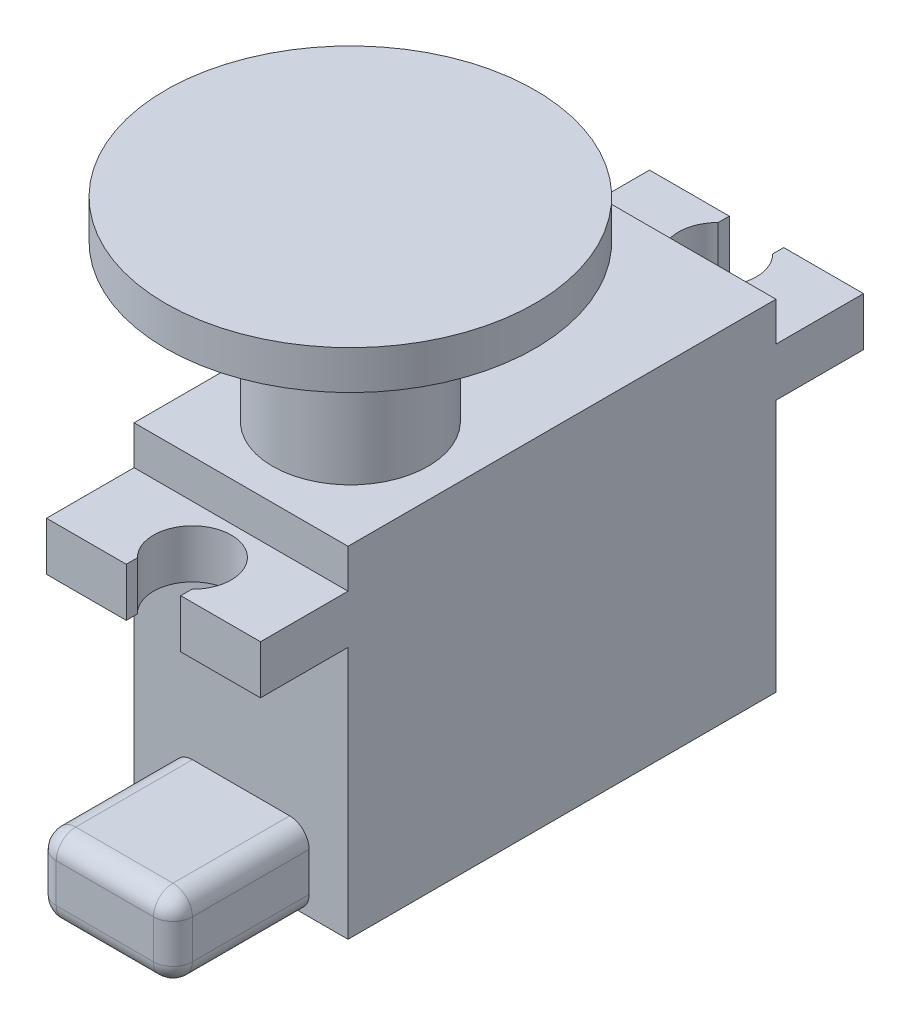
ISO-10303-21;
HEADER;
FILE_DESCRIPTION(('STEP AP214'),'2;1');
FILE_NAME('part.step','',(''),(''),'','','');
FILE_SCHEMA(('AUTOMOTIVE_DESIGN { 1 0 10303 214 1 1 1 1 }'));
ENDSEC;
DATA;
#1=APPLICATION_CONTEXT('core data for automotive mechanical design processes');
#2=APPLICATION_PROTOCOL_DEFINITION('international standard','automotive_design',2000,#1);
#3=PRODUCT_CONTEXT('',#1,'mechanical');
#4=PRODUCT('Part','Part','',(#3));
#5=PRODUCT_RELATED_PRODUCT_CATEGORY('part','',(#4));
#6=PRODUCT_DEFINITION_FORMATION('','',#4);
#7=PRODUCT_DEFINITION_CONTEXT('part definition',#1,'design');
#8=PRODUCT_DEFINITION('design','',#6,#7);
#9=PRODUCT_DEFINITION_SHAPE('','',#8);
#10=(LENGTH_UNIT() NAMED_UNIT(*) SI_UNIT(.MILLI.,.METRE.));
#11=(NAMED_UNIT(*) PLANE_ANGLE_UNIT() SI_UNIT($,.RADIAN.));
#12=(NAMED_UNIT(*) SI_UNIT($,.STERADIAN.) SOLID_ANGLE_UNIT());
#13=UNCERTAINTY_MEASURE_WITH_UNIT(LENGTH_MEASURE(1.E-05),#10,'distance_accuracy_value','');
#14=(GEOMETRIC_REPRESENTATION_CONTEXT(3) GLOBAL_UNCERTAINTY_ASSIGNED_CONTEXT((#13)) GLOBAL_UNIT_ASSIGNED_CONTEXT((#10,
#11,#12)) REPRESENTATION_CONTEXT('',''));
#15=CARTESIAN_POINT('',(0.,0.,0.));
#16=DIRECTION('',(0.,0.,1.));
#17=DIRECTION('',(1.,0.,0.));
#18=AXIS2_PLACEMENT_3D('',#15,#16,#17);
#19=CARTESIAN_POINT('',(0.,0.,-15.5));
#20=DIRECTION('',(0.,0.,-1.));
#21=DIRECTION('',(-1.,0.,0.));
#22=AXIS2_PLACEMENT_3D('',#19,#20,#21);
#23=PLANE('',#22);
#24=DIRECTION('',(0.,1.,0.));
#25=VECTOR('',#24,1.);
#26=CARTESIAN_POINT('',(-1.4,0.,-15.5));
#27=LINE('',#26,#25);
#28=CARTESIAN_POINT('',(-1.4,13.,-15.5));
#29=VERTEX_POINT('',#28);
#30=CARTESIAN_POINT('',(-1.4,15.5,-15.5));
#31=VERTEX_POINT('',#30);
#32=EDGE_CURVE('E42',#29,#31,#27,.T.);
#33=ORIENTED_EDGE('',*,*,#32,.F.);
#34=DIRECTION('',(-1.,0.,0.));
#35=VECTOR('',#34,1.);
#36=CARTESIAN_POINT('',(5.5,13.,-15.5));
#37=LINE('',#36,#35);
#38=CARTESIAN_POINT('',(-5.5,13.,-15.5));
#39=VERTEX_POINT('',#38);
#40=EDGE_CURVE('E278',#29,#39,#37,.T.);
#41=ORIENTED_EDGE('',*,*,#40,.T.);
#42=DIRECTION('',(0.,1.,0.));
#43=VECTOR('',#42,1.);
#44=CARTESIAN_POINT('',(-5.5,15.5,-15.5));
#45=LINE('',#44,#43);
#46=CARTESIAN_POINT('',(-5.5,15.5,-15.5));
#47=VERTEX_POINT('',#46);
#48=EDGE_CURVE('E282',#39,#47,#45,.T.);
#49=ORIENTED_EDGE('',*,*,#48,.T.);
#50=DIRECTION('',(1.,0.,0.));
#51=VECTOR('',#50,1.);
#52=CARTESIAN_POINT('',(5.5,15.5,-15.5));
#53=LINE('',#52,#51);
#54=EDGE_CURVE('E285',#47,#31,#53,.T.);
#55=ORIENTED_EDGE('',*,*,#54,.T.);
#56=EDGE_LOOP('',(#33,#41,#49,#55));
#57=FACE_BOUND('',#56,.T.);
#58=ADVANCED_FACE('F34',(#57),#23,.T.);
#59=CARTESIAN_POINT('',(0.,0.,15.5));
#60=DIRECTION('',(0.,0.,1.));
#61=DIRECTION('',(1.,0.,0.));
#62=AXIS2_PLACEMENT_3D('',#59,#60,#61);
#63=PLANE('',#62);
#64=DIRECTION('',(0.,1.,0.));
#65=VECTOR('',#64,1.);
#66=CARTESIAN_POINT('',(1.4,0.,15.5));
#67=LINE('',#66,#65);
#68=CARTESIAN_POINT('',(1.4,13.,15.5));
#69=VERTEX_POINT('',#68);
#70=CARTESIAN_POINT('',(1.4,15.5,15.5));
#71=VERTEX_POINT('',#70);
#72=EDGE_CURVE('E324',#69,#71,#67,.T.);
#73=ORIENTED_EDGE('',*,*,#72,.F.);
#74=DIRECTION('',(1.,0.,0.));
#75=VECTOR('',#74,1.);
#76=CARTESIAN_POINT('',(-5.5,13.,15.5));
#77=LINE('',#76,#75);
#78=CARTESIAN_POINT('',(5.5,13.,15.5));
#79=VERTEX_POINT('',#78);
#80=EDGE_CURVE('E606',#69,#79,#77,.T.);
#81=ORIENTED_EDGE('',*,*,#80,.T.);
#82=DIRECTION('',(0.,1.,0.));
#83=VECTOR('',#82,1.);
#84=CARTESIAN_POINT('',(5.5,15.5,15.5));
#85=LINE('',#84,#83);
#86=CARTESIAN_POINT('',(5.5,15.5,15.5));
#87=VERTEX_POINT('',#86);
#88=EDGE_CURVE('E719',#79,#87,#85,.T.);
#89=ORIENTED_EDGE('',*,*,#88,.T.);
#90=DIRECTION('',(-1.,0.,0.));
#91=VECTOR('',#90,1.);
#92=CARTESIAN_POINT('',(-5.5,15.5,15.5));
#93=LINE('',#92,#91);
#94=EDGE_CURVE('E613',#87,#71,#93,.T.);
#95=ORIENTED_EDGE('',*,*,#94,.T.);
#96=EDGE_LOOP('',(#73,#81,#89,#95));
#97=FACE_BOUND('',#96,.T.);
#98=ADVANCED_FACE('F397',(#97),#63,.T.);
#99=CARTESIAN_POINT('',(5.5,17.5,-11.));
#100=DIRECTION('',(0.,0.,1.));
#101=DIRECTION('',(1.,0.,0.));
#102=AXIS2_PLACEMENT_3D('',#99,#100,#101);
#103=PLANE('',#102);
#104=DIRECTION('',(1.,0.,0.));
#105=VECTOR('',#104,1.);
#106=CARTESIAN_POINT('',(5.5,15.5,-11.));
#107=LINE('',#106,#105);
#108=CARTESIAN_POINT('',(-5.5,15.5,-11.));
#109=VERTEX_POINT('',#108);
#110=CARTESIAN_POINT('',(5.5,15.5,-11.));
#111=VERTEX_POINT('',#110);
#112=EDGE_CURVE('E279',#109,#111,#107,.T.);
#113=ORIENTED_EDGE('',*,*,#112,.F.);
#114=DIRECTION('',(0.,-1.,0.));
#115=VECTOR('',#114,1.);
#116=CARTESIAN_POINT('',(-5.5,17.5,-11.));
#117=LINE('',#116,#115);
#118=CARTESIAN_POINT('',(-5.5,17.5,-11.));
#119=VERTEX_POINT('',#118);
#120=EDGE_CURVE('E347',#119,#109,#117,.T.);
#121=ORIENTED_EDGE('',*,*,#120,.F.);
#122=DIRECTION('',(-1.,0.,0.));
#123=VECTOR('',#122,1.);
#124=CARTESIAN_POINT('',(5.5,17.5,-11.));
#125=LINE('',#124,#123);
#126=CARTESIAN_POINT('',(5.5,17.5,-11.));
#127=VERTEX_POINT('',#126);
#128=EDGE_CURVE('E573',#127,#119,#125,.T.);
#129=ORIENTED_EDGE('',*,*,#128,.F.);
#130=DIRECTION('',(0.,-1.,0.));
#131=VECTOR('',#130,1.);
#132=CARTESIAN_POINT('',(5.5,17.5,-11.));
#133=LINE('',#132,#131);
#134=EDGE_CURVE('E357',#127,#111,#133,.T.);
#135=ORIENTED_EDGE('',*,*,#134,.T.);
#136=EDGE_LOOP('',(#113,#121,#129,#135));
#137=FACE_BOUND('',#136,.T.);
#138=ADVANCED_FACE('F402',(#137),#103,.F.);
#139=DIRECTION('',(-1.,0.,0.));
#140=VECTOR('',#139,1.);
#141=CARTESIAN_POINT('',(5.5,13.,-11.));
#142=LINE('',#141,#140);
#143=CARTESIAN_POINT('',(5.5,13.,-11.));
#144=VERTEX_POINT('',#143);
#145=CARTESIAN_POINT('',(-5.5,13.,-11.));
#146=VERTEX_POINT('',#145);
#147=EDGE_CURVE('E274',#144,#146,#142,.T.);
#148=ORIENTED_EDGE('',*,*,#147,.F.);
#149=CARTESIAN_POINT('',(5.5,0.,-11.));
#150=VERTEX_POINT('',#149);
#151=EDGE_CURVE('E297',#144,#150,#133,.T.);
#152=ORIENTED_EDGE('',*,*,#151,.T.);
#153=DIRECTION('',(-1.,0.,0.));
#154=VECTOR('',#153,1.);
#155=CARTESIAN_POINT('',(5.5,0.,-11.));
#156=LINE('',#155,#154);
#157=CARTESIAN_POINT('',(-5.5,0.,-11.));
#158=VERTEX_POINT('',#157);
#159=EDGE_CURVE('E539',#150,#158,#156,.T.);
#160=ORIENTED_EDGE('',*,*,#159,.T.);
#161=EDGE_CURVE('E536',#146,#158,#117,.T.);
#162=ORIENTED_EDGE('',*,*,#161,.F.);
#163=EDGE_LOOP('',(#148,#152,#160,#162));
#164=FACE_BOUND('',#163,.T.);
#165=ADVANCED_FACE('F459',(#164),#103,.F.);
#166=CARTESIAN_POINT('',(5.5,17.5,11.));
#167=DIRECTION('',(0.,0.,-1.));
#168=DIRECTION('',(-1.,0.,0.));
#169=AXIS2_PLACEMENT_3D('',#166,#167,#168);
#170=PLANE('',#169);
#171=DIRECTION('',(1.,0.,0.));
#172=VECTOR('',#171,1.);
#173=CARTESIAN_POINT('',(-5.5,13.,11.));
#174=LINE('',#173,#172);
#175=CARTESIAN_POINT('',(-5.5,13.,11.));
#176=VERTEX_POINT('',#175);
#177=CARTESIAN_POINT('',(5.5,13.,11.));
#178=VERTEX_POINT('',#177);
#179=EDGE_CURVE('E309',#176,#178,#174,.T.);
#180=ORIENTED_EDGE('',*,*,#179,.F.);
#181=DIRECTION('',(0.,-1.,0.));
#182=VECTOR('',#181,1.);
#183=CARTESIAN_POINT('',(-5.5,17.5,11.));
#184=LINE('',#183,#182);
#185=CARTESIAN_POINT('',(-5.5,0.,11.));
#186=VERTEX_POINT('',#185);
#187=EDGE_CURVE('E587',#176,#186,#184,.T.);
#188=ORIENTED_EDGE('',*,*,#187,.T.);
#189=DIRECTION('',(1.,0.,0.));
#190=VECTOR('',#189,1.);
#191=CARTESIAN_POINT('',(5.5,0.,11.));
#192=LINE('',#191,#190);
#193=CARTESIAN_POINT('',(-2.5,0.,11.));
#194=VERTEX_POINT('',#193);
#195=EDGE_CURVE('E556',#186,#194,#192,.T.);
#196=ORIENTED_EDGE('',*,*,#195,.T.);
#197=CARTESIAN_POINT('',(-2.5,1.,11.));
#198=DIRECTION('',(0.,0.,-1.));
#199=DIRECTION('',(-1.,0.,0.));
#200=AXIS2_PLACEMENT_3D('',#197,#198,#199);
#201=CIRCLE('',#200,1.);
#202=CARTESIAN_POINT('',(-3.5,1.,11.));
#203=VERTEX_POINT('',#202);
#204=EDGE_CURVE('E644',#194,#203,#201,.T.);
#205=ORIENTED_EDGE('',*,*,#204,.T.);
#206=DIRECTION('',(0.,-1.,0.));
#207=VECTOR('',#206,1.);
#208=CARTESIAN_POINT('',(-3.5,0.,11.));
#209=LINE('',#208,#207);
#210=CARTESIAN_POINT('',(-3.5,3.00000000000001,11.));
#211=VERTEX_POINT('',#210);
#212=EDGE_CURVE('E577',#211,#203,#209,.T.);
#213=ORIENTED_EDGE('',*,*,#212,.F.);
#214=CARTESIAN_POINT('',(-2.5,3.00000000000001,11.));
#215=DIRECTION('',(0.,0.,-1.));
#216=DIRECTION('',(-1.,0.,0.));
#217=AXIS2_PLACEMENT_3D('',#214,#215,#216);
#218=CIRCLE('',#217,1.);
#219=CARTESIAN_POINT('',(-2.5,4.00000000000001,11.));
#220=VERTEX_POINT('',#219);
#221=EDGE_CURVE('E646',#211,#220,#218,.T.);
#222=ORIENTED_EDGE('',*,*,#221,.T.);
#223=DIRECTION('',(-1.,0.,0.));
#224=VECTOR('',#223,1.);
#225=CARTESIAN_POINT('',(-3.5,4.00000000000001,11.));
#226=LINE('',#225,#224);
#227=CARTESIAN_POINT('',(2.5,4.00000000000001,11.));
#228=VERTEX_POINT('',#227);
#229=EDGE_CURVE('E528',#228,#220,#226,.T.);
#230=ORIENTED_EDGE('',*,*,#229,.F.);
#231=CARTESIAN_POINT('',(2.5,3.00000000000001,11.));
#232=DIRECTION('',(0.,0.,-1.));
#233=DIRECTION('',(-1.,0.,0.));
#234=AXIS2_PLACEMENT_3D('',#231,#232,#233);
#235=CIRCLE('',#234,1.);
#236=CARTESIAN_POINT('',(3.5,3.00000000000001,11.));
#237=VERTEX_POINT('',#236);
#238=EDGE_CURVE('E648',#228,#237,#235,.T.);
#239=ORIENTED_EDGE('',*,*,#238,.T.);
#240=DIRECTION('',(0.,1.,0.));
#241=VECTOR('',#240,1.);
#242=CARTESIAN_POINT('',(3.5,0.,11.));
#243=LINE('',#242,#241);
#244=CARTESIAN_POINT('',(3.5,1.,11.));
#245=VERTEX_POINT('',#244);
#246=EDGE_CURVE('E524',#245,#237,#243,.T.);
#247=ORIENTED_EDGE('',*,*,#246,.F.);
#248=CARTESIAN_POINT('',(2.5,1.,11.));
#249=DIRECTION('',(0.,0.,-1.));
#250=DIRECTION('',(-1.,0.,0.));
#251=AXIS2_PLACEMENT_3D('',#248,#249,#250);
#252=CIRCLE('',#251,1.);
#253=CARTESIAN_POINT('',(2.5,0.,11.));
#254=VERTEX_POINT('',#253);
#255=EDGE_CURVE('E650',#245,#254,#252,.T.);
#256=ORIENTED_EDGE('',*,*,#255,.T.);
#257=CARTESIAN_POINT('',(5.5,0.,11.));
#258=VERTEX_POINT('',#257);
#259=EDGE_CURVE('E576',#254,#258,#192,.T.);
#260=ORIENTED_EDGE('',*,*,#259,.T.);
#261=DIRECTION('',(0.,-1.,0.));
#262=VECTOR('',#261,1.);
#263=CARTESIAN_POINT('',(5.5,17.5,11.));
#264=LINE('',#263,#262);
#265=EDGE_CURVE('E547',#178,#258,#264,.T.);
#266=ORIENTED_EDGE('',*,*,#265,.F.);
#267=EDGE_LOOP('',(#180,#188,#196,#205,#213,#222,#230,#239,#247,#256,#260,#266));
#268=FACE_BOUND('',#267,.T.);
#269=ADVANCED_FACE('F462',(#268),#170,.F.);
#270=DIRECTION('',(-1.,0.,0.));
#271=VECTOR('',#270,1.);
#272=CARTESIAN_POINT('',(-5.5,15.5,11.));
#273=LINE('',#272,#271);
#274=CARTESIAN_POINT('',(5.5,15.5,11.));
#275=VERTEX_POINT('',#274);
#276=CARTESIAN_POINT('',(-5.5,15.5,11.));
#277=VERTEX_POINT('',#276);
#278=EDGE_CURVE('E600',#275,#277,#273,.T.);
#279=ORIENTED_EDGE('',*,*,#278,.F.);
#280=CARTESIAN_POINT('',(5.5,17.5,11.));
#281=VERTEX_POINT('',#280);
#282=EDGE_CURVE('E544',#281,#275,#264,.T.);
#283=ORIENTED_EDGE('',*,*,#282,.F.);
#284=DIRECTION('',(1.,0.,0.));
#285=VECTOR('',#284,1.);
#286=CARTESIAN_POINT('',(5.5,17.5,11.));
#287=LINE('',#286,#285);
#288=CARTESIAN_POINT('',(-5.5,17.5,11.));
#289=VERTEX_POINT('',#288);
#290=EDGE_CURVE('E562',#289,#281,#287,.T.);
#291=ORIENTED_EDGE('',*,*,#290,.F.);
#292=EDGE_CURVE('E584',#289,#277,#184,.T.);
#293=ORIENTED_EDGE('',*,*,#292,.T.);
#294=EDGE_LOOP('',(#279,#283,#291,#293));
#295=FACE_BOUND('',#294,.T.);
#296=ADVANCED_FACE('F465',(#295),#170,.F.);
#297=CARTESIAN_POINT('',(-5.5,17.5,11.));
#298=DIRECTION('',(1.,0.,0.));
#299=DIRECTION('',(0.,0.,-1.));
#300=AXIS2_PLACEMENT_3D('',#297,#298,#299);
#301=PLANE('',#300);
#302=DIRECTION('',(0.,0.,1.));
#303=VECTOR('',#302,1.);
#304=CARTESIAN_POINT('',(-5.5,0.,11.));
#305=LINE('',#304,#303);
#306=EDGE_CURVE('E559',#158,#186,#305,.T.);
#307=ORIENTED_EDGE('',*,*,#306,.T.);
#308=ORIENTED_EDGE('',*,*,#187,.F.);
#309=DIRECTION('',(0.,0.,-1.));
#310=VECTOR('',#309,1.);
#311=CARTESIAN_POINT('',(-5.5,13.,15.5));
#312=LINE('',#311,#310);
#313=CARTESIAN_POINT('',(-5.5,13.,15.5));
#314=VERTEX_POINT('',#313);
#315=EDGE_CURVE('E617',#314,#176,#312,.T.);
#316=ORIENTED_EDGE('',*,*,#315,.F.);
#317=DIRECTION('',(0.,-1.,0.));
#318=VECTOR('',#317,1.);
#319=CARTESIAN_POINT('',(-5.5,15.5,15.5));
#320=LINE('',#319,#318);
#321=CARTESIAN_POINT('',(-5.5,15.5,15.5));
#322=VERTEX_POINT('',#321);
#323=EDGE_CURVE('E603',#322,#314,#320,.T.);
#324=ORIENTED_EDGE('',*,*,#323,.F.);
#325=DIRECTION('',(0.,0.,-1.));
#326=VECTOR('',#325,1.);
#327=CARTESIAN_POINT('',(-5.5,15.5,15.5));
#328=LINE('',#327,#326);
#329=EDGE_CURVE('E611',#322,#277,#328,.T.);
#330=ORIENTED_EDGE('',*,*,#329,.T.);
#331=ORIENTED_EDGE('',*,*,#292,.F.);
#332=DIRECTION('',(0.,0.,1.));
#333=VECTOR('',#332,1.);
#334=CARTESIAN_POINT('',(-5.5,17.5,11.));
#335=LINE('',#334,#333);
#336=EDGE_CURVE('E560',#119,#289,#335,.T.);
#337=ORIENTED_EDGE('',*,*,#336,.F.);
#338=ORIENTED_EDGE('',*,*,#120,.T.);
#339=DIRECTION('',(0.,0.,1.));
#340=VECTOR('',#339,1.);
#341=CARTESIAN_POINT('',(-5.5,15.5,-15.5));
#342=LINE('',#341,#340);
#343=EDGE_CURVE('E304',#47,#109,#342,.T.);
#344=ORIENTED_EDGE('',*,*,#343,.F.);
#345=ORIENTED_EDGE('',*,*,#48,.F.);
#346=DIRECTION('',(0.,0.,1.));
#347=VECTOR('',#346,1.);
#348=CARTESIAN_POINT('',(-5.5,13.,-15.5));
#349=LINE('',#348,#347);
#350=EDGE_CURVE('E300',#39,#146,#349,.T.);
#351=ORIENTED_EDGE('',*,*,#350,.T.);
#352=ORIENTED_EDGE('',*,*,#161,.T.);
#353=EDGE_LOOP('',(#307,#308,#316,#324,#330,#331,#337,#338,#344,#345,#351,#352));
#354=FACE_BOUND('',#353,.T.);
#355=ADVANCED_FACE('F344',(#354),#301,.F.);
#356=CARTESIAN_POINT('',(5.5,17.5,11.));
#357=DIRECTION('',(-1.,0.,0.));
#358=DIRECTION('',(0.,0.,1.));
#359=AXIS2_PLACEMENT_3D('',#356,#357,#358);
#360=PLANE('',#359);
#361=DIRECTION('',(0.,0.,-1.));
#362=VECTOR('',#361,1.);
#363=CARTESIAN_POINT('',(5.5,0.,11.));
#364=LINE('',#363,#362);
#365=EDGE_CURVE('E553',#258,#150,#364,.T.);
#366=ORIENTED_EDGE('',*,*,#365,.T.);
#367=ORIENTED_EDGE('',*,*,#151,.F.);
#368=DIRECTION('',(0.,0.,1.));
#369=VECTOR('',#368,1.);
#370=CARTESIAN_POINT('',(5.5,13.,-15.5));
#371=LINE('',#370,#369);
#372=CARTESIAN_POINT('',(5.5,13.,-15.5));
#373=VERTEX_POINT('',#372);
#374=EDGE_CURVE('E303',#373,#144,#371,.T.);
#375=ORIENTED_EDGE('',*,*,#374,.F.);
#376=DIRECTION('',(0.,-1.,0.));
#377=VECTOR('',#376,1.);
#378=CARTESIAN_POINT('',(5.5,15.5,-15.5));
#379=LINE('',#378,#377);
#380=CARTESIAN_POINT('',(5.5,15.5,-15.5));
#381=VERTEX_POINT('',#380);
#382=EDGE_CURVE('E275',#381,#373,#379,.T.);
#383=ORIENTED_EDGE('',*,*,#382,.F.);
#384=DIRECTION('',(0.,0.,1.));
#385=VECTOR('',#384,1.);
#386=CARTESIAN_POINT('',(5.5,15.5,-15.5));
#387=LINE('',#386,#385);
#388=EDGE_CURVE('E288',#381,#111,#387,.T.);
#389=ORIENTED_EDGE('',*,*,#388,.T.);
#390=ORIENTED_EDGE('',*,*,#134,.F.);
#391=DIRECTION('',(0.,0.,-1.));
#392=VECTOR('',#391,1.);
#393=CARTESIAN_POINT('',(5.5,17.5,11.));
#394=LINE('',#393,#392);
#395=EDGE_CURVE('E566',#281,#127,#394,.T.);
#396=ORIENTED_EDGE('',*,*,#395,.F.);
#397=ORIENTED_EDGE('',*,*,#282,.T.);
#398=DIRECTION('',(0.,0.,-1.));
#399=VECTOR('',#398,1.);
#400=CARTESIAN_POINT('',(5.5,15.5,15.5));
#401=LINE('',#400,#399);
#402=EDGE_CURVE('E598',#87,#275,#401,.T.);
#403=ORIENTED_EDGE('',*,*,#402,.F.);
#404=ORIENTED_EDGE('',*,*,#88,.F.);
#405=DIRECTION('',(0.,0.,-1.));
#406=VECTOR('',#405,1.);
#407=CARTESIAN_POINT('',(5.5,13.,15.5));
#408=LINE('',#407,#406);
#409=EDGE_CURVE('E615',#79,#178,#408,.T.);
#410=ORIENTED_EDGE('',*,*,#409,.T.);
#411=ORIENTED_EDGE('',*,*,#265,.T.);
#412=EDGE_LOOP('',(#366,#367,#375,#383,#389,#390,#396,#397,#403,#404,#410,#411));
#413=FACE_BOUND('',#412,.T.);
#414=ADVANCED_FACE('F355',(#413),#360,.F.);
#415=CARTESIAN_POINT('',(0.,17.5,0.));
#416=DIRECTION('',(0.,1.,0.));
#417=DIRECTION('',(0.,0.,1.));
#418=AXIS2_PLACEMENT_3D('',#415,#416,#417);
#419=PLANE('',#418);
#420=CARTESIAN_POINT('',(0.,17.5,5.38022134045235));
#421=DIRECTION('',(0.,1.,0.));
#422=DIRECTION('',(0.,0.,1.));
#423=AXIS2_PLACEMENT_3D('',#420,#421,#422);
#424=CIRCLE('',#423,4.);
#425=CARTESIAN_POINT('',(0.,17.5,9.38022134045235));
#426=VERTEX_POINT('',#425);
#427=EDGE_CURVE('E367',#426,#426,#424,.T.);
#428=ORIENTED_EDGE('',*,*,#427,.F.);
#429=EDGE_LOOP('',(#428));
#430=FACE_BOUND('',#429,.T.);
#431=ORIENTED_EDGE('',*,*,#336,.T.);
#432=ORIENTED_EDGE('',*,*,#290,.T.);
#433=ORIENTED_EDGE('',*,*,#395,.T.);
#434=ORIENTED_EDGE('',*,*,#128,.T.);
#435=EDGE_LOOP('',(#431,#432,#433,#434));
#436=FACE_BOUND('',#435,.T.);
#437=ADVANCED_FACE('F450',(#430,#436),#419,.T.);
#438=CARTESIAN_POINT('',(0.,0.,0.));
#439=DIRECTION('',(0.,1.,0.));
#440=DIRECTION('',(0.,0.,1.));
#441=AXIS2_PLACEMENT_3D('',#438,#439,#440);
#442=PLANE('',#441);
#443=DIRECTION('',(0.,0.,-1.));
#444=VECTOR('',#443,1.);
#445=CARTESIAN_POINT('',(2.5,0.,0.));
#446=LINE('',#445,#444);
#447=CARTESIAN_POINT('',(2.5,0.,17.));
#448=VERTEX_POINT('',#447);
#449=EDGE_CURVE('E586',#254,#448,#446,.F.);
#450=ORIENTED_EDGE('',*,*,#449,.T.);
#451=DIRECTION('',(1.,0.,0.));
#452=VECTOR('',#451,1.);
#453=CARTESIAN_POINT('',(0.,0.,17.));
#454=LINE('',#453,#452);
#455=CARTESIAN_POINT('',(-2.5,0.,17.));
#456=VERTEX_POINT('',#455);
#457=EDGE_CURVE('E518',#448,#456,#454,.F.);
#458=ORIENTED_EDGE('',*,*,#457,.T.);
#459=DIRECTION('',(0.,0.,-1.));
#460=VECTOR('',#459,1.);
#461=CARTESIAN_POINT('',(-2.5,0.,0.));
#462=LINE('',#461,#460);
#463=EDGE_CURVE('E590',#456,#194,#462,.T.);
#464=ORIENTED_EDGE('',*,*,#463,.T.);
#465=ORIENTED_EDGE('',*,*,#195,.F.);
#466=ORIENTED_EDGE('',*,*,#306,.F.);
#467=ORIENTED_EDGE('',*,*,#159,.F.);
#468=ORIENTED_EDGE('',*,*,#365,.F.);
#469=ORIENTED_EDGE('',*,*,#259,.F.);
#470=EDGE_LOOP('',(#450,#458,#464,#465,#466,#467,#468,#469));
#471=FACE_BOUND('',#470,.T.);
#472=ADVANCED_FACE('F448',(#471),#442,.F.);
#473=CARTESIAN_POINT('',(3.5,0.,18.));
#474=DIRECTION('',(-1.,0.,0.));
#475=DIRECTION('',(0.,0.,1.));
#476=AXIS2_PLACEMENT_3D('',#473,#474,#475);
#477=PLANE('',#476);
#478=DIRECTION('',(0.,0.,-1.));
#479=VECTOR('',#478,1.);
#480=CARTESIAN_POINT('',(3.5,3.00000000000001,18.));
#481=LINE('',#480,#479);
#482=CARTESIAN_POINT('',(3.5,3.00000000000001,17.));
#483=VERTEX_POINT('',#482);
#484=EDGE_CURVE('E641',#237,#483,#481,.F.);
#485=ORIENTED_EDGE('',*,*,#484,.T.);
#486=DIRECTION('',(0.,1.,0.));
#487=VECTOR('',#486,1.);
#488=CARTESIAN_POINT('',(3.5,0.,17.));
#489=LINE('',#488,#487);
#490=CARTESIAN_POINT('',(3.5,1.,17.));
#491=VERTEX_POINT('',#490);
#492=EDGE_CURVE('E673',#483,#491,#489,.F.);
#493=ORIENTED_EDGE('',*,*,#492,.T.);
#494=DIRECTION('',(0.,0.,-1.));
#495=VECTOR('',#494,1.);
#496=CARTESIAN_POINT('',(3.5,1.,18.));
#497=LINE('',#496,#495);
#498=EDGE_CURVE('E637',#491,#245,#497,.T.);
#499=ORIENTED_EDGE('',*,*,#498,.T.);
#500=ORIENTED_EDGE('',*,*,#246,.T.);
#501=EDGE_LOOP('',(#485,#493,#499,#500));
#502=FACE_BOUND('',#501,.T.);
#503=ADVANCED_FACE('F444',(#502),#477,.F.);
#504=CARTESIAN_POINT('',(-3.5,4.00000000000001,18.));
#505=DIRECTION('',(0.,-1.,0.));
#506=DIRECTION('',(0.,0.,-1.));
#507=AXIS2_PLACEMENT_3D('',#504,#505,#506);
#508=PLANE('',#507);
#509=DIRECTION('',(0.,0.,-1.));
#510=VECTOR('',#509,1.);
#511=CARTESIAN_POINT('',(-2.5,4.00000000000001,18.));
#512=LINE('',#511,#510);
#513=CARTESIAN_POINT('',(-2.5,4.00000000000001,17.));
#514=VERTEX_POINT('',#513);
#515=EDGE_CURVE('E636',#220,#514,#512,.F.);
#516=ORIENTED_EDGE('',*,*,#515,.T.);
#517=DIRECTION('',(-1.,0.,0.));
#518=VECTOR('',#517,1.);
#519=CARTESIAN_POINT('',(-3.5,4.00000000000001,17.));
#520=LINE('',#519,#518);
#521=CARTESIAN_POINT('',(2.5,4.00000000000001,17.));
#522=VERTEX_POINT('',#521);
#523=EDGE_CURVE('E325',#514,#522,#520,.F.);
#524=ORIENTED_EDGE('',*,*,#523,.T.);
#525=DIRECTION('',(0.,0.,-1.));
#526=VECTOR('',#525,1.);
#527=CARTESIAN_POINT('',(2.5,4.00000000000001,18.));
#528=LINE('',#527,#526);
#529=EDGE_CURVE('E634',#522,#228,#528,.T.);
#530=ORIENTED_EDGE('',*,*,#529,.T.);
#531=ORIENTED_EDGE('',*,*,#229,.T.);
#532=EDGE_LOOP('',(#516,#524,#530,#531));
#533=FACE_BOUND('',#532,.T.);
#534=ADVANCED_FACE('F440',(#533),#508,.F.);
#535=CARTESIAN_POINT('',(-3.5,0.,18.));
#536=DIRECTION('',(1.,0.,0.));
#537=DIRECTION('',(0.,1.,0.));
#538=AXIS2_PLACEMENT_3D('',#535,#536,#537);
#539=PLANE('',#538);
#540=DIRECTION('',(0.,0.,-1.));
#541=VECTOR('',#540,1.);
#542=CARTESIAN_POINT('',(-3.5,1.,18.));
#543=LINE('',#542,#541);
#544=CARTESIAN_POINT('',(-3.5,1.,17.));
#545=VERTEX_POINT('',#544);
#546=EDGE_CURVE('E632',#203,#545,#543,.F.);
#547=ORIENTED_EDGE('',*,*,#546,.T.);
#548=DIRECTION('',(0.,-1.,0.));
#549=VECTOR('',#548,1.);
#550=CARTESIAN_POINT('',(-3.5,0.,17.));
#551=LINE('',#550,#549);
#552=CARTESIAN_POINT('',(-3.5,3.00000000000001,17.));
#553=VERTEX_POINT('',#552);
#554=EDGE_CURVE('E670',#545,#553,#551,.F.);
#555=ORIENTED_EDGE('',*,*,#554,.T.);
#556=DIRECTION('',(0.,0.,-1.));
#557=VECTOR('',#556,1.);
#558=CARTESIAN_POINT('',(-3.5,3.00000000000001,18.));
#559=LINE('',#558,#557);
#560=EDGE_CURVE('E630',#553,#211,#559,.T.);
#561=ORIENTED_EDGE('',*,*,#560,.T.);
#562=ORIENTED_EDGE('',*,*,#212,.T.);
#563=EDGE_LOOP('',(#547,#555,#561,#562));
#564=FACE_BOUND('',#563,.T.);
#565=ADVANCED_FACE('F436',(#564),#539,.F.);
#566=CARTESIAN_POINT('',(0.,0.,18.));
#567=DIRECTION('',(0.,0.,-1.));
#568=DIRECTION('',(-1.,0.,0.));
#569=AXIS2_PLACEMENT_3D('',#566,#567,#568);
#570=PLANE('',#569);
#571=DIRECTION('',(-1.,0.,0.));
#572=VECTOR('',#571,1.);
#573=CARTESIAN_POINT('',(0.,3.00000000000001,18.));
#574=LINE('',#573,#572);
#575=CARTESIAN_POINT('',(2.5,3.00000000000001,18.));
#576=VERTEX_POINT('',#575);
#577=CARTESIAN_POINT('',(-2.5,3.00000000000001,18.));
#578=VERTEX_POINT('',#577);
#579=EDGE_CURVE('E662',#576,#578,#574,.T.);
#580=ORIENTED_EDGE('',*,*,#579,.T.);
#581=DIRECTION('',(0.,-1.,0.));
#582=VECTOR('',#581,1.);
#583=CARTESIAN_POINT('',(-2.5,0.,18.));
#584=LINE('',#583,#582);
#585=CARTESIAN_POINT('',(-2.5,1.,18.));
#586=VERTEX_POINT('',#585);
#587=EDGE_CURVE('E667',#578,#586,#584,.T.);
#588=ORIENTED_EDGE('',*,*,#587,.T.);
#589=DIRECTION('',(1.,0.,0.));
#590=VECTOR('',#589,1.);
#591=CARTESIAN_POINT('',(0.,1.,18.));
#592=LINE('',#591,#590);
#593=CARTESIAN_POINT('',(2.5,1.,18.));
#594=VERTEX_POINT('',#593);
#595=EDGE_CURVE('E520',#586,#594,#592,.T.);
#596=ORIENTED_EDGE('',*,*,#595,.T.);
#597=DIRECTION('',(0.,1.,0.));
#598=VECTOR('',#597,1.);
#599=CARTESIAN_POINT('',(2.5,0.,18.));
#600=LINE('',#599,#598);
#601=EDGE_CURVE('E664',#594,#576,#600,.T.);
#602=ORIENTED_EDGE('',*,*,#601,.T.);
#603=EDGE_LOOP('',(#580,#588,#596,#602));
#604=FACE_BOUND('',#603,.T.);
#605=ADVANCED_FACE('F432',(#604),#570,.F.);
#606=CARTESIAN_POINT('',(-2.5,1.,0.));
#607=DIRECTION('',(0.,0.,-1.));
#608=DIRECTION('',(-1.,0.,0.));
#609=AXIS2_PLACEMENT_3D('',#606,#607,#608);
#610=CYLINDRICAL_SURFACE('',#609,1.);
#611=ORIENTED_EDGE('',*,*,#463,.F.);
#612=CARTESIAN_POINT('',(-2.5,1.,17.));
#613=DIRECTION('',(0.,0.,-1.));
#614=DIRECTION('',(-1.,0.,0.));
#615=AXIS2_PLACEMENT_3D('',#612,#613,#614);
#616=CIRCLE('',#615,1.);
#617=EDGE_CURVE('E658',#456,#545,#616,.T.);
#618=ORIENTED_EDGE('',*,*,#617,.T.);
#619=ORIENTED_EDGE('',*,*,#546,.F.);
#620=ORIENTED_EDGE('',*,*,#204,.F.);
#621=EDGE_LOOP('',(#611,#618,#619,#620));
#622=FACE_BOUND('',#621,.T.);
#623=ADVANCED_FACE('F435',(#622),#610,.T.);
#624=CARTESIAN_POINT('',(-2.5,3.00000000000001,18.));
#625=DIRECTION('',(0.,0.,-1.));
#626=DIRECTION('',(-1.,0.,0.));
#627=AXIS2_PLACEMENT_3D('',#624,#625,#626);
#628=CYLINDRICAL_SURFACE('',#627,1.);
#629=ORIENTED_EDGE('',*,*,#560,.F.);
#630=CARTESIAN_POINT('',(-2.5,3.00000000000001,17.));
#631=DIRECTION('',(0.,0.,-1.));
#632=DIRECTION('',(-1.,0.,0.));
#633=AXIS2_PLACEMENT_3D('',#630,#631,#632);
#634=CIRCLE('',#633,1.);
#635=EDGE_CURVE('E660',#553,#514,#634,.T.);
#636=ORIENTED_EDGE('',*,*,#635,.T.);
#637=ORIENTED_EDGE('',*,*,#515,.F.);
#638=ORIENTED_EDGE('',*,*,#221,.F.);
#639=EDGE_LOOP('',(#629,#636,#637,#638));
#640=FACE_BOUND('',#639,.T.);
#641=ADVANCED_FACE('F471',(#640),#628,.T.);
#642=CARTESIAN_POINT('',(2.5,3.00000000000001,18.));
#643=DIRECTION('',(0.,0.,-1.));
#644=DIRECTION('',(-1.,0.,0.));
#645=AXIS2_PLACEMENT_3D('',#642,#643,#644);
#646=CYLINDRICAL_SURFACE('',#645,1.);
#647=ORIENTED_EDGE('',*,*,#529,.F.);
#648=CARTESIAN_POINT('',(2.5,3.00000000000001,17.));
#649=DIRECTION('',(0.,0.,-1.));
#650=DIRECTION('',(-1.,0.,0.));
#651=AXIS2_PLACEMENT_3D('',#648,#649,#650);
#652=CIRCLE('',#651,1.);
#653=EDGE_CURVE('E653',#522,#483,#652,.T.);
#654=ORIENTED_EDGE('',*,*,#653,.T.);
#655=ORIENTED_EDGE('',*,*,#484,.F.);
#656=ORIENTED_EDGE('',*,*,#238,.F.);
#657=EDGE_LOOP('',(#647,#654,#655,#656));
#658=FACE_BOUND('',#657,.T.);
#659=ADVANCED_FACE('F475',(#658),#646,.T.);
#660=CARTESIAN_POINT('',(2.5,1.,18.));
#661=DIRECTION('',(0.,0.,-1.));
#662=DIRECTION('',(-1.,0.,0.));
#663=AXIS2_PLACEMENT_3D('',#660,#661,#662);
#664=CYLINDRICAL_SURFACE('',#663,1.);
#665=ORIENTED_EDGE('',*,*,#498,.F.);
#666=CARTESIAN_POINT('',(2.5,1.,17.));
#667=DIRECTION('',(0.,0.,-1.));
#668=DIRECTION('',(-1.,0.,0.));
#669=AXIS2_PLACEMENT_3D('',#666,#667,#668);
#670=CIRCLE('',#669,1.);
#671=EDGE_CURVE('E656',#491,#448,#670,.T.);
#672=ORIENTED_EDGE('',*,*,#671,.T.);
#673=ORIENTED_EDGE('',*,*,#449,.F.);
#674=ORIENTED_EDGE('',*,*,#255,.F.);
#675=EDGE_LOOP('',(#665,#672,#673,#674));
#676=FACE_BOUND('',#675,.T.);
#677=ADVANCED_FACE('F479',(#676),#664,.T.);
#678=CARTESIAN_POINT('',(-2.5,1.,17.));
#679=DIRECTION('',(0.,0.,-1.));
#680=DIRECTION('',(-1.,0.,0.));
#681=AXIS2_PLACEMENT_3D('',#678,#679,#680);
#682=SPHERICAL_SURFACE('',#681,1.);
#683=CARTESIAN_POINT('',(-2.5,1.,17.));
#684=DIRECTION('',(0.,1.,0.));
#685=DIRECTION('',(0.,0.,1.));
#686=AXIS2_PLACEMENT_3D('',#683,#684,#685);
#687=CIRCLE('',#686,1.);
#688=EDGE_CURVE('E525',#545,#586,#687,.T.);
#689=ORIENTED_EDGE('',*,*,#688,.F.);
#690=ORIENTED_EDGE('',*,*,#617,.F.);
#691=CARTESIAN_POINT('',(-2.5,1.,17.));
#692=DIRECTION('',(1.,0.,0.));
#693=DIRECTION('',(0.,0.,-1.));
#694=AXIS2_PLACEMENT_3D('',#691,#692,#693);
#695=CIRCLE('',#694,1.);
#696=EDGE_CURVE('E516',#586,#456,#695,.T.);
#697=ORIENTED_EDGE('',*,*,#696,.F.);
#698=EDGE_LOOP('',(#689,#690,#697));
#699=FACE_BOUND('',#698,.T.);
#700=ADVANCED_FACE('F36',(#699),#682,.T.);
#701=CARTESIAN_POINT('',(0.,1.,17.));
#702=DIRECTION('',(1.,0.,0.));
#703=DIRECTION('',(0.,0.,-1.));
#704=AXIS2_PLACEMENT_3D('',#701,#702,#703);
#705=CYLINDRICAL_SURFACE('',#704,1.);
#706=ORIENTED_EDGE('',*,*,#696,.T.);
#707=ORIENTED_EDGE('',*,*,#457,.F.);
#708=CARTESIAN_POINT('',(2.5,1.,17.));
#709=DIRECTION('',(1.,0.,0.));
#710=DIRECTION('',(0.,0.,-1.));
#711=AXIS2_PLACEMENT_3D('',#708,#709,#710);
#712=CIRCLE('',#711,1.);
#713=EDGE_CURVE('E530',#594,#448,#712,.T.);
#714=ORIENTED_EDGE('',*,*,#713,.F.);
#715=ORIENTED_EDGE('',*,*,#595,.F.);
#716=EDGE_LOOP('',(#706,#707,#714,#715));
#717=FACE_BOUND('',#716,.T.);
#718=ADVANCED_FACE('F505',(#717),#705,.T.);
#719=CARTESIAN_POINT('',(-2.5,0.,17.));
#720=DIRECTION('',(0.,-1.,0.));
#721=DIRECTION('',(1.,0.,0.));
#722=AXIS2_PLACEMENT_3D('',#719,#720,#721);
#723=CYLINDRICAL_SURFACE('',#722,1.);
#724=ORIENTED_EDGE('',*,*,#688,.T.);
#725=ORIENTED_EDGE('',*,*,#587,.F.);
#726=CARTESIAN_POINT('',(-2.5,3.00000000000001,17.));
#727=DIRECTION('',(0.,1.,0.));
#728=DIRECTION('',(0.,0.,1.));
#729=AXIS2_PLACEMENT_3D('',#726,#727,#728);
#730=CIRCLE('',#729,1.);
#731=EDGE_CURVE('E686',#553,#578,#730,.T.);
#732=ORIENTED_EDGE('',*,*,#731,.F.);
#733=ORIENTED_EDGE('',*,*,#554,.F.);
#734=EDGE_LOOP('',(#724,#725,#732,#733));
#735=FACE_BOUND('',#734,.T.);
#736=ADVANCED_FACE('F502',(#735),#723,.T.);
#737=CARTESIAN_POINT('',(2.5,1.,17.));
#738=DIRECTION('',(0.,0.,-1.));
#739=DIRECTION('',(-1.,0.,0.));
#740=AXIS2_PLACEMENT_3D('',#737,#738,#739);
#741=SPHERICAL_SURFACE('',#740,1.);
#742=ORIENTED_EDGE('',*,*,#713,.T.);
#743=ORIENTED_EDGE('',*,*,#671,.F.);
#744=CARTESIAN_POINT('',(2.5,1.,17.));
#745=DIRECTION('',(0.,1.,0.));
#746=DIRECTION('',(0.,0.,1.));
#747=AXIS2_PLACEMENT_3D('',#744,#745,#746);
#748=CIRCLE('',#747,1.);
#749=EDGE_CURVE('E683',#594,#491,#748,.T.);
#750=ORIENTED_EDGE('',*,*,#749,.F.);
#751=EDGE_LOOP('',(#742,#743,#750));
#752=FACE_BOUND('',#751,.T.);
#753=ADVANCED_FACE('F498',(#752),#741,.T.);
#754=CARTESIAN_POINT('',(-2.5,3.00000000000001,17.));
#755=DIRECTION('',(0.,0.,-1.));
#756=DIRECTION('',(-1.,0.,0.));
#757=AXIS2_PLACEMENT_3D('',#754,#755,#756);
#758=SPHERICAL_SURFACE('',#757,1.);
#759=ORIENTED_EDGE('',*,*,#635,.F.);
#760=ORIENTED_EDGE('',*,*,#731,.T.);
#761=CARTESIAN_POINT('',(-2.5,3.00000000000001,17.));
#762=DIRECTION('',(1.,0.,0.));
#763=DIRECTION('',(0.,0.,-1.));
#764=AXIS2_PLACEMENT_3D('',#761,#762,#763);
#765=CIRCLE('',#764,1.);
#766=EDGE_CURVE('E680',#514,#578,#765,.T.);
#767=ORIENTED_EDGE('',*,*,#766,.F.);
#768=EDGE_LOOP('',(#759,#760,#767));
#769=FACE_BOUND('',#768,.T.);
#770=ADVANCED_FACE('F494',(#769),#758,.T.);
#771=CARTESIAN_POINT('',(2.5,0.,17.));
#772=DIRECTION('',(0.,1.,0.));
#773=DIRECTION('',(0.,0.,1.));
#774=AXIS2_PLACEMENT_3D('',#771,#772,#773);
#775=CYLINDRICAL_SURFACE('',#774,1.);
#776=ORIENTED_EDGE('',*,*,#749,.T.);
#777=ORIENTED_EDGE('',*,*,#492,.F.);
#778=CARTESIAN_POINT('',(2.5,3.00000000000001,17.));
#779=DIRECTION('',(0.,1.,0.));
#780=DIRECTION('',(0.,0.,1.));
#781=AXIS2_PLACEMENT_3D('',#778,#779,#780);
#782=CIRCLE('',#781,1.);
#783=EDGE_CURVE('E678',#576,#483,#782,.T.);
#784=ORIENTED_EDGE('',*,*,#783,.F.);
#785=ORIENTED_EDGE('',*,*,#601,.F.);
#786=EDGE_LOOP('',(#776,#777,#784,#785));
#787=FACE_BOUND('',#786,.T.);
#788=ADVANCED_FACE('F490',(#787),#775,.T.);
#789=CARTESIAN_POINT('',(0.,3.00000000000001,17.));
#790=DIRECTION('',(-1.,0.,0.));
#791=DIRECTION('',(0.,0.,1.));
#792=AXIS2_PLACEMENT_3D('',#789,#790,#791);
#793=CYLINDRICAL_SURFACE('',#792,1.);
#794=ORIENTED_EDGE('',*,*,#766,.T.);
#795=ORIENTED_EDGE('',*,*,#579,.F.);
#796=CARTESIAN_POINT('',(2.5,3.00000000000001,17.));
#797=DIRECTION('',(1.,0.,0.));
#798=DIRECTION('',(0.,0.,-1.));
#799=AXIS2_PLACEMENT_3D('',#796,#797,#798);
#800=CIRCLE('',#799,1.);
#801=EDGE_CURVE('E618',#522,#576,#800,.T.);
#802=ORIENTED_EDGE('',*,*,#801,.F.);
#803=ORIENTED_EDGE('',*,*,#523,.F.);
#804=EDGE_LOOP('',(#794,#795,#802,#803));
#805=FACE_BOUND('',#804,.T.);
#806=ADVANCED_FACE('F486',(#805),#793,.T.);
#807=CARTESIAN_POINT('',(2.5,3.00000000000001,17.));
#808=DIRECTION('',(0.,0.,-1.));
#809=DIRECTION('',(-1.,0.,0.));
#810=AXIS2_PLACEMENT_3D('',#807,#808,#809);
#811=SPHERICAL_SURFACE('',#810,1.);
#812=ORIENTED_EDGE('',*,*,#783,.T.);
#813=ORIENTED_EDGE('',*,*,#653,.F.);
#814=ORIENTED_EDGE('',*,*,#801,.T.);
#815=EDGE_LOOP('',(#812,#813,#814));
#816=FACE_BOUND('',#815,.T.);
#817=ADVANCED_FACE('F430',(#816),#811,.T.);
#818=CARTESIAN_POINT('',(-5.5,13.,15.5));
#819=DIRECTION('',(0.,1.,0.));
#820=DIRECTION('',(0.,0.,1.));
#821=AXIS2_PLACEMENT_3D('',#818,#819,#820);
#822=PLANE('',#821);
#823=ORIENTED_EDGE('',*,*,#80,.F.);
#824=DIRECTION('',(0.,0.,-1.));
#825=VECTOR('',#824,1.);
#826=CARTESIAN_POINT('',(1.4,13.,15.5));
#827=LINE('',#826,#825);
#828=CARTESIAN_POINT('',(1.4,13.,14.9282856857086));
#829=VERTEX_POINT('',#828);
#830=EDGE_CURVE('E268',#69,#829,#827,.T.);
#831=ORIENTED_EDGE('',*,*,#830,.T.);
#832=CARTESIAN_POINT('',(0.,13.,13.5));
#833=DIRECTION('',(0.,1.,0.));
#834=DIRECTION('',(0.,0.,1.));
#835=AXIS2_PLACEMENT_3D('',#832,#833,#834);
#836=CIRCLE('',#835,2.);
#837=CARTESIAN_POINT('',(-1.4,13.,14.9282856857086));
#838=VERTEX_POINT('',#837);
#839=EDGE_CURVE('E271',#829,#838,#836,.T.);
#840=ORIENTED_EDGE('',*,*,#839,.T.);
#841=DIRECTION('',(0.,0.,1.));
#842=VECTOR('',#841,1.);
#843=CARTESIAN_POINT('',(-1.4,13.,15.5));
#844=LINE('',#843,#842);
#845=CARTESIAN_POINT('',(-1.4,13.,15.5));
#846=VERTEX_POINT('',#845);
#847=EDGE_CURVE('E262',#838,#846,#844,.T.);
#848=ORIENTED_EDGE('',*,*,#847,.T.);
#849=EDGE_CURVE('E710',#314,#846,#77,.T.);
#850=ORIENTED_EDGE('',*,*,#849,.F.);
#851=ORIENTED_EDGE('',*,*,#315,.T.);
#852=ORIENTED_EDGE('',*,*,#179,.T.);
#853=ORIENTED_EDGE('',*,*,#409,.F.);
#854=EDGE_LOOP('',(#823,#831,#840,#848,#850,#851,#852,#853));
#855=FACE_BOUND('',#854,.T.);
#856=ADVANCED_FACE('F426',(#855),#822,.F.);
#857=CARTESIAN_POINT('',(-5.5,15.5,15.5));
#858=DIRECTION('',(0.,-1.,0.));
#859=DIRECTION('',(0.,0.,-1.));
#860=AXIS2_PLACEMENT_3D('',#857,#858,#859);
#861=PLANE('',#860);
#862=CARTESIAN_POINT('',(0.,15.5,13.5));
#863=DIRECTION('',(0.,-1.,0.));
#864=DIRECTION('',(0.,0.,-1.));
#865=AXIS2_PLACEMENT_3D('',#862,#863,#864);
#866=CIRCLE('',#865,2.);
#867=CARTESIAN_POINT('',(-1.4,15.5,14.9282856857086));
#868=VERTEX_POINT('',#867);
#869=CARTESIAN_POINT('',(1.4,15.5,14.9282856857086));
#870=VERTEX_POINT('',#869);
#871=EDGE_CURVE('E327',#868,#870,#866,.T.);
#872=ORIENTED_EDGE('',*,*,#871,.T.);
#873=DIRECTION('',(0.,0.,1.));
#874=VECTOR('',#873,1.);
#875=CARTESIAN_POINT('',(1.4,15.5,15.5));
#876=LINE('',#875,#874);
#877=EDGE_CURVE('E265',#870,#71,#876,.T.);
#878=ORIENTED_EDGE('',*,*,#877,.T.);
#879=ORIENTED_EDGE('',*,*,#94,.F.);
#880=ORIENTED_EDGE('',*,*,#402,.T.);
#881=ORIENTED_EDGE('',*,*,#278,.T.);
#882=ORIENTED_EDGE('',*,*,#329,.F.);
#883=CARTESIAN_POINT('',(-1.4,15.5,15.5));
#884=VERTEX_POINT('',#883);
#885=EDGE_CURVE('E722',#884,#322,#93,.T.);
#886=ORIENTED_EDGE('',*,*,#885,.F.);
#887=DIRECTION('',(0.,0.,-1.));
#888=VECTOR('',#887,1.);
#889=CARTESIAN_POINT('',(-1.4,15.5,15.5));
#890=LINE('',#889,#888);
#891=EDGE_CURVE('E57',#884,#868,#890,.T.);
#892=ORIENTED_EDGE('',*,*,#891,.T.);
#893=EDGE_LOOP('',(#872,#878,#879,#880,#881,#882,#886,#892));
#894=FACE_BOUND('',#893,.T.);
#895=ADVANCED_FACE('F422',(#894),#861,.F.);
#896=DIRECTION('',(0.,-1.,0.));
#897=VECTOR('',#896,1.);
#898=CARTESIAN_POINT('',(-1.4,0.,15.5));
#899=LINE('',#898,#897);
#900=EDGE_CURVE('E322',#884,#846,#899,.T.);
#901=ORIENTED_EDGE('',*,*,#900,.F.);
#902=ORIENTED_EDGE('',*,*,#885,.T.);
#903=ORIENTED_EDGE('',*,*,#323,.T.);
#904=ORIENTED_EDGE('',*,*,#849,.T.);
#905=EDGE_LOOP('',(#901,#902,#903,#904));
#906=FACE_BOUND('',#905,.T.);
#907=ADVANCED_FACE('F405',(#906),#63,.T.);
#908=CARTESIAN_POINT('',(5.5,13.,-15.5));
#909=DIRECTION('',(0.,1.,0.));
#910=DIRECTION('',(0.,0.,1.));
#911=AXIS2_PLACEMENT_3D('',#908,#909,#910);
#912=PLANE('',#911);
#913=ORIENTED_EDGE('',*,*,#40,.F.);
#914=DIRECTION('',(0.,0.,1.));
#915=VECTOR('',#914,1.);
#916=CARTESIAN_POINT('',(-1.4,13.,-15.5));
#917=LINE('',#916,#915);
#918=CARTESIAN_POINT('',(-1.4,13.,-14.9282856857086));
#919=VERTEX_POINT('',#918);
#920=EDGE_CURVE('E251',#29,#919,#917,.T.);
#921=ORIENTED_EDGE('',*,*,#920,.T.);
#922=CARTESIAN_POINT('',(0.,13.,-13.5));
#923=DIRECTION('',(0.,1.,0.));
#924=DIRECTION('',(0.,0.,1.));
#925=AXIS2_PLACEMENT_3D('',#922,#923,#924);
#926=CIRCLE('',#925,2.);
#927=CARTESIAN_POINT('',(1.4,13.,-14.9282856857086));
#928=VERTEX_POINT('',#927);
#929=EDGE_CURVE('E244',#919,#928,#926,.T.);
#930=ORIENTED_EDGE('',*,*,#929,.T.);
#931=DIRECTION('',(0.,0.,-1.));
#932=VECTOR('',#931,1.);
#933=CARTESIAN_POINT('',(1.4,13.,-15.5));
#934=LINE('',#933,#932);
#935=CARTESIAN_POINT('',(1.4,13.,-15.5));
#936=VERTEX_POINT('',#935);
#937=EDGE_CURVE('E231',#928,#936,#934,.T.);
#938=ORIENTED_EDGE('',*,*,#937,.T.);
#939=EDGE_CURVE('E280',#373,#936,#37,.T.);
#940=ORIENTED_EDGE('',*,*,#939,.F.);
#941=ORIENTED_EDGE('',*,*,#374,.T.);
#942=ORIENTED_EDGE('',*,*,#147,.T.);
#943=ORIENTED_EDGE('',*,*,#350,.F.);
#944=EDGE_LOOP('',(#913,#921,#930,#938,#940,#941,#942,#943));
#945=FACE_BOUND('',#944,.T.);
#946=ADVANCED_FACE('F250',(#945),#912,.F.);
#947=CARTESIAN_POINT('',(5.5,15.5,-15.5));
#948=DIRECTION('',(0.,-1.,0.));
#949=DIRECTION('',(0.,0.,-1.));
#950=AXIS2_PLACEMENT_3D('',#947,#948,#949);
#951=PLANE('',#950);
#952=CARTESIAN_POINT('',(0.,15.5,-13.5));
#953=DIRECTION('',(0.,-1.,0.));
#954=DIRECTION('',(0.,0.,-1.));
#955=AXIS2_PLACEMENT_3D('',#952,#953,#954);
#956=CIRCLE('',#955,2.);
#957=CARTESIAN_POINT('',(1.4,15.5,-14.9282856857086));
#958=VERTEX_POINT('',#957);
#959=CARTESIAN_POINT('',(-1.4,15.5,-14.9282856857086));
#960=VERTEX_POINT('',#959);
#961=EDGE_CURVE('E11',#958,#960,#956,.T.);
#962=ORIENTED_EDGE('',*,*,#961,.T.);
#963=DIRECTION('',(0.,0.,-1.));
#964=VECTOR('',#963,1.);
#965=CARTESIAN_POINT('',(-1.4,15.5,-15.5));
#966=LINE('',#965,#964);
#967=EDGE_CURVE('E239',#960,#31,#966,.T.);
#968=ORIENTED_EDGE('',*,*,#967,.T.);
#969=ORIENTED_EDGE('',*,*,#54,.F.);
#970=ORIENTED_EDGE('',*,*,#343,.T.);
#971=ORIENTED_EDGE('',*,*,#112,.T.);
#972=ORIENTED_EDGE('',*,*,#388,.F.);
#973=CARTESIAN_POINT('',(1.4,15.5,-15.5));
#974=VERTEX_POINT('',#973);
#975=EDGE_CURVE('E284',#974,#381,#53,.T.);
#976=ORIENTED_EDGE('',*,*,#975,.F.);
#977=DIRECTION('',(0.,0.,1.));
#978=VECTOR('',#977,1.);
#979=CARTESIAN_POINT('',(1.4,15.5,-15.5));
#980=LINE('',#979,#978);
#981=EDGE_CURVE('E49',#974,#958,#980,.T.);
#982=ORIENTED_EDGE('',*,*,#981,.T.);
#983=EDGE_LOOP('',(#962,#968,#969,#970,#971,#972,#976,#982));
#984=FACE_BOUND('',#983,.T.);
#985=ADVANCED_FACE('F337',(#984),#951,.F.);
#986=DIRECTION('',(0.,-1.,0.));
#987=VECTOR('',#986,1.);
#988=CARTESIAN_POINT('',(1.4,0.,-15.5));
#989=LINE('',#988,#987);
#990=EDGE_CURVE('E235',#974,#936,#989,.T.);
#991=ORIENTED_EDGE('',*,*,#990,.F.);
#992=ORIENTED_EDGE('',*,*,#975,.T.);
#993=ORIENTED_EDGE('',*,*,#382,.T.);
#994=ORIENTED_EDGE('',*,*,#939,.T.);
#995=EDGE_LOOP('',(#991,#992,#993,#994));
#996=FACE_BOUND('',#995,.T.);
#997=ADVANCED_FACE('F362',(#996),#23,.T.);
#998=CARTESIAN_POINT('',(0.,12.5,13.5));
#999=DIRECTION('',(0.,1.,0.));
#1000=DIRECTION('',(0.,0.,1.));
#1001=AXIS2_PLACEMENT_3D('',#998,#999,#1000);
#1002=CYLINDRICAL_SURFACE('',#1001,2.);
#1003=DIRECTION('',(0.,1.,0.));
#1004=VECTOR('',#1003,1.);
#1005=CARTESIAN_POINT('',(1.4,12.5,14.9282856857086));
#1006=LINE('',#1005,#1004);
#1007=EDGE_CURVE('E254',#829,#870,#1006,.T.);
#1008=ORIENTED_EDGE('',*,*,#1007,.T.);
#1009=ORIENTED_EDGE('',*,*,#871,.F.);
#1010=DIRECTION('',(0.,1.,0.));
#1011=VECTOR('',#1010,1.);
#1012=CARTESIAN_POINT('',(-1.4,12.5,14.9282856857086));
#1013=LINE('',#1012,#1011);
#1014=EDGE_CURVE('E252',#838,#868,#1013,.T.);
#1015=ORIENTED_EDGE('',*,*,#1014,.F.);
#1016=ORIENTED_EDGE('',*,*,#839,.F.);
#1017=EDGE_LOOP('',(#1008,#1009,#1015,#1016));
#1018=FACE_BOUND('',#1017,.T.);
#1019=ADVANCED_FACE('F409',(#1018),#1002,.F.);
#1020=CARTESIAN_POINT('',(1.4,12.5,15.5));
#1021=DIRECTION('',(1.,0.,0.));
#1022=DIRECTION('',(0.,0.,-1.));
#1023=AXIS2_PLACEMENT_3D('',#1020,#1021,#1022);
#1024=PLANE('',#1023);
#1025=ORIENTED_EDGE('',*,*,#72,.T.);
#1026=ORIENTED_EDGE('',*,*,#877,.F.);
#1027=ORIENTED_EDGE('',*,*,#1007,.F.);
#1028=ORIENTED_EDGE('',*,*,#830,.F.);
#1029=EDGE_LOOP('',(#1025,#1026,#1027,#1028));
#1030=FACE_BOUND('',#1029,.T.);
#1031=ADVANCED_FACE('F414',(#1030),#1024,.F.);
#1032=CARTESIAN_POINT('',(-1.4,12.5,15.5));
#1033=DIRECTION('',(-1.,0.,0.));
#1034=DIRECTION('',(0.,0.,1.));
#1035=AXIS2_PLACEMENT_3D('',#1032,#1033,#1034);
#1036=PLANE('',#1035);
#1037=ORIENTED_EDGE('',*,*,#1014,.T.);
#1038=ORIENTED_EDGE('',*,*,#891,.F.);
#1039=ORIENTED_EDGE('',*,*,#900,.T.);
#1040=ORIENTED_EDGE('',*,*,#847,.F.);
#1041=EDGE_LOOP('',(#1037,#1038,#1039,#1040));
#1042=FACE_BOUND('',#1041,.T.);
#1043=ADVANCED_FACE('F726',(#1042),#1036,.F.);
#1044=CARTESIAN_POINT('',(0.,12.5,-13.5));
#1045=DIRECTION('',(0.,1.,0.));
#1046=DIRECTION('',(0.,0.,1.));
#1047=AXIS2_PLACEMENT_3D('',#1044,#1045,#1046);
#1048=CYLINDRICAL_SURFACE('',#1047,2.);
#1049=DIRECTION('',(0.,1.,0.));
#1050=VECTOR('',#1049,1.);
#1051=CARTESIAN_POINT('',(-1.4,12.5,-14.9282856857086));
#1052=LINE('',#1051,#1050);
#1053=EDGE_CURVE('E246',#919,#960,#1052,.T.);
#1054=ORIENTED_EDGE('',*,*,#1053,.T.);
#1055=ORIENTED_EDGE('',*,*,#961,.F.);
#1056=DIRECTION('',(0.,1.,0.));
#1057=VECTOR('',#1056,1.);
#1058=CARTESIAN_POINT('',(1.4,12.5,-14.9282856857086));
#1059=LINE('',#1058,#1057);
#1060=EDGE_CURVE('E234',#928,#958,#1059,.T.);
#1061=ORIENTED_EDGE('',*,*,#1060,.F.);
#1062=ORIENTED_EDGE('',*,*,#929,.F.);
#1063=EDGE_LOOP('',(#1054,#1055,#1061,#1062));
#1064=FACE_BOUND('',#1063,.T.);
#1065=ADVANCED_FACE('F243',(#1064),#1048,.F.);
#1066=CARTESIAN_POINT('',(-1.4,12.5,-15.5));
#1067=DIRECTION('',(-1.,0.,0.));
#1068=DIRECTION('',(0.,0.,1.));
#1069=AXIS2_PLACEMENT_3D('',#1066,#1067,#1068);
#1070=PLANE('',#1069);
#1071=ORIENTED_EDGE('',*,*,#32,.T.);
#1072=ORIENTED_EDGE('',*,*,#967,.F.);
#1073=ORIENTED_EDGE('',*,*,#1053,.F.);
#1074=ORIENTED_EDGE('',*,*,#920,.F.);
#1075=EDGE_LOOP('',(#1071,#1072,#1073,#1074));
#1076=FACE_BOUND('',#1075,.T.);
#1077=ADVANCED_FACE('F333',(#1076),#1070,.F.);
#1078=CARTESIAN_POINT('',(1.4,12.5,-15.5));
#1079=DIRECTION('',(1.,0.,0.));
#1080=DIRECTION('',(0.,0.,-1.));
#1081=AXIS2_PLACEMENT_3D('',#1078,#1079,#1080);
#1082=PLANE('',#1081);
#1083=ORIENTED_EDGE('',*,*,#1060,.T.);
#1084=ORIENTED_EDGE('',*,*,#981,.F.);
#1085=ORIENTED_EDGE('',*,*,#990,.T.);
#1086=ORIENTED_EDGE('',*,*,#937,.F.);
#1087=EDGE_LOOP('',(#1083,#1084,#1085,#1086));
#1088=FACE_BOUND('',#1087,.T.);
#1089=ADVANCED_FACE('F233',(#1088),#1082,.F.);
#1090=CARTESIAN_POINT('',(0.,25.5,5.38022134045235));
#1091=DIRECTION('',(0.,-1.,0.));
#1092=DIRECTION('',(0.,0.,-1.));
#1093=AXIS2_PLACEMENT_3D('',#1090,#1091,#1092);
#1094=CYLINDRICAL_SURFACE('',#1093,4.);
#1095=CARTESIAN_POINT('',(0.,25.5,5.38022134045235));
#1096=DIRECTION('',(0.,1.,0.));
#1097=DIRECTION('',(0.,0.,1.));
#1098=AXIS2_PLACEMENT_3D('',#1095,#1096,#1097);
#1099=CIRCLE('',#1098,4.);
#1100=CARTESIAN_POINT('',(0.,25.5,9.38022134045235));
#1101=VERTEX_POINT('',#1100);
#1102=EDGE_CURVE('E365',#1101,#1101,#1099,.T.);
#1103=ORIENTED_EDGE('',*,*,#1102,.F.);
#1104=EDGE_LOOP('',(#1103));
#1105=FACE_BOUND('',#1104,.T.);
#1106=ORIENTED_EDGE('',*,*,#427,.T.);
#1107=EDGE_LOOP('',(#1106));
#1108=FACE_BOUND('',#1107,.T.);
#1109=ADVANCED_FACE('F384',(#1105,#1108),#1094,.T.);
#1110=CARTESIAN_POINT('',(0.,27.5,5.38022134045235));
#1111=DIRECTION('',(0.,-1.,0.));
#1112=DIRECTION('',(0.,0.,-1.));
#1113=AXIS2_PLACEMENT_3D('',#1110,#1111,#1112);
#1114=CYLINDRICAL_SURFACE('',#1113,9.5);
#1115=CARTESIAN_POINT('',(0.,27.5,5.38022134045235));
#1116=DIRECTION('',(0.,1.,0.));
#1117=DIRECTION('',(0.,0.,1.));
#1118=AXIS2_PLACEMENT_3D('',#1115,#1116,#1117);
#1119=CIRCLE('',#1118,9.5);
#1120=CARTESIAN_POINT('',(0.,27.5,14.8802213404524));
#1121=VERTEX_POINT('',#1120);
#1122=EDGE_CURVE('E370',#1121,#1121,#1119,.T.);
#1123=ORIENTED_EDGE('',*,*,#1122,.F.);
#1124=EDGE_LOOP('',(#1123));
#1125=FACE_BOUND('',#1124,.T.);
#1126=CARTESIAN_POINT('',(0.,25.5,5.38022134045235));
#1127=DIRECTION('',(0.,1.,0.));
#1128=DIRECTION('',(0.,0.,1.));
#1129=AXIS2_PLACEMENT_3D('',#1126,#1127,#1128);
#1130=CIRCLE('',#1129,9.5);
#1131=CARTESIAN_POINT('',(0.,25.5,14.8802213404524));
#1132=VERTEX_POINT('',#1131);
#1133=EDGE_CURVE('E373',#1132,#1132,#1130,.T.);
#1134=ORIENTED_EDGE('',*,*,#1133,.T.);
#1135=EDGE_LOOP('',(#1134));
#1136=FACE_BOUND('',#1135,.T.);
#1137=ADVANCED_FACE('F381',(#1125,#1136),#1114,.T.);
#1138=CARTESIAN_POINT('',(0.,27.5,5.38022134045235));
#1139=DIRECTION('',(0.,1.,0.));
#1140=DIRECTION('',(0.,0.,1.));
#1141=AXIS2_PLACEMENT_3D('',#1138,#1139,#1140);
#1142=PLANE('',#1141);
#1143=ORIENTED_EDGE('',*,*,#1122,.T.);
#1144=EDGE_LOOP('',(#1143));
#1145=FACE_BOUND('',#1144,.T.);
#1146=ADVANCED_FACE('F379',(#1145),#1142,.T.);
#1147=CARTESIAN_POINT('',(0.,25.5,5.38022134045235));
#1148=DIRECTION('',(0.,1.,0.));
#1149=DIRECTION('',(0.,0.,1.));
#1150=AXIS2_PLACEMENT_3D('',#1147,#1148,#1149);
#1151=PLANE('',#1150);
#1152=ORIENTED_EDGE('',*,*,#1102,.T.);
#1153=EDGE_LOOP('',(#1152));
#1154=FACE_BOUND('',#1153,.T.);
#1155=ORIENTED_EDGE('',*,*,#1133,.F.);
#1156=EDGE_LOOP('',(#1155));
#1157=FACE_BOUND('',#1156,.T.);
#1158=ADVANCED_FACE('F388',(#1154,#1157),#1151,.F.);
#1159=CLOSED_SHELL('',(#58,#98,#138,#165,#269,#296,#355,#414,#437,#472,#503,#534,#565,#605,#623,
#641,#659,#677,#700,#718,#736,#753,#770,#788,#806,#817,#856,#895,#907,#946,#985,#997,#1019,
#1031,#1043,#1065,#1077,#1089,#1109,#1137,#1146,#1158));
#1160=MANIFOLD_SOLID_BREP('B2',#1159);
#1161=ADVANCED_BREP_SHAPE_REPRESENTATION('',(#18,#1160),#14);
#1162=SHAPE_DEFINITION_REPRESENTATION(#9,#1161);
ENDSEC;
END-ISO-10303-21;
